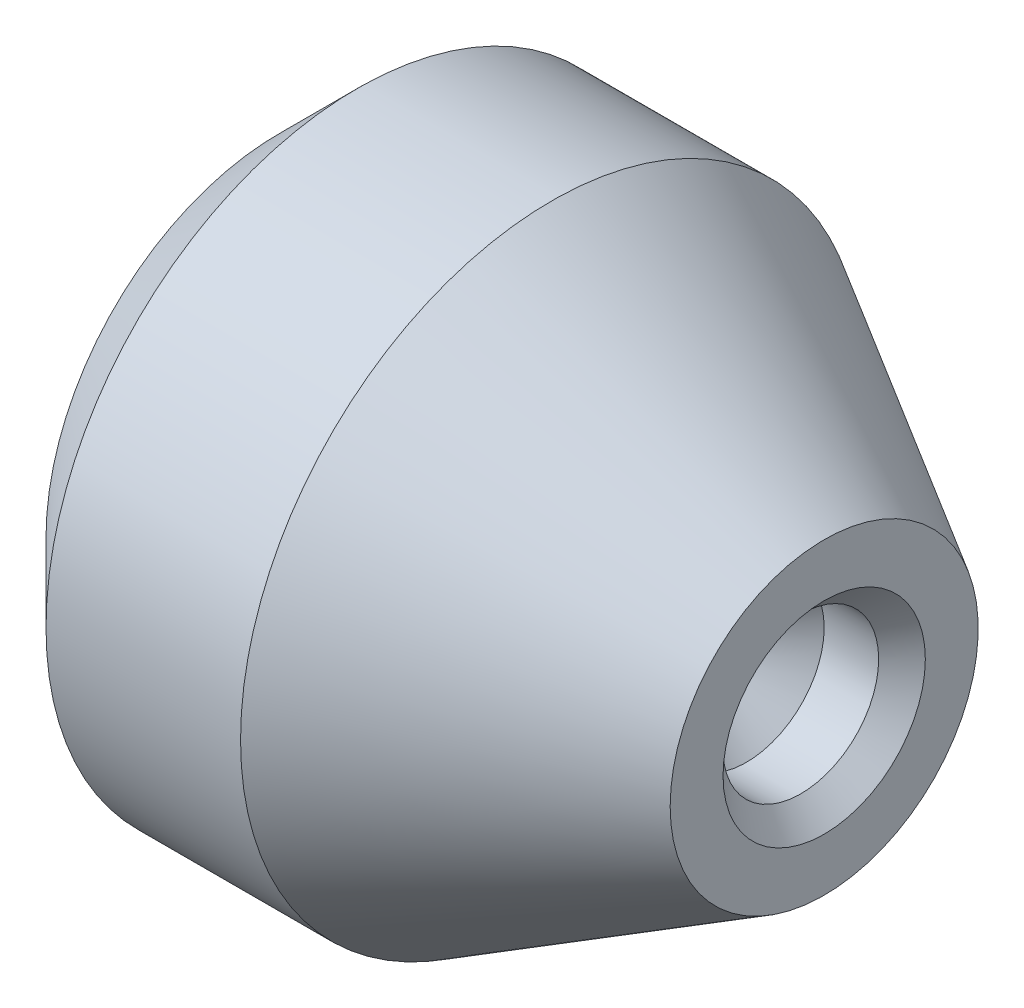
ISO-10303-21;
HEADER;
FILE_DESCRIPTION(('STEP AP214'),'2;1');
FILE_NAME('part.step','',(''),(''),'','','');
FILE_SCHEMA(('AUTOMOTIVE_DESIGN { 1 0 10303 214 1 1 1 1 }'));
ENDSEC;
DATA;
#1=APPLICATION_CONTEXT('core data for automotive mechanical design processes');
#2=APPLICATION_PROTOCOL_DEFINITION('international standard','automotive_design',2000,#1);
#3=PRODUCT_CONTEXT('',#1,'mechanical');
#4=PRODUCT('Part','Part','',(#3));
#5=PRODUCT_RELATED_PRODUCT_CATEGORY('part','',(#4));
#6=PRODUCT_DEFINITION_FORMATION('','',#4);
#7=PRODUCT_DEFINITION_CONTEXT('part definition',#1,'design');
#8=PRODUCT_DEFINITION('design','',#6,#7);
#9=PRODUCT_DEFINITION_SHAPE('','',#8);
#10=(LENGTH_UNIT() NAMED_UNIT(*) SI_UNIT(.MILLI.,.METRE.));
#11=(NAMED_UNIT(*) PLANE_ANGLE_UNIT() SI_UNIT($,.RADIAN.));
#12=(NAMED_UNIT(*) SI_UNIT($,.STERADIAN.) SOLID_ANGLE_UNIT());
#13=UNCERTAINTY_MEASURE_WITH_UNIT(LENGTH_MEASURE(1.E-05),#10,'distance_accuracy_value','');
#14=(GEOMETRIC_REPRESENTATION_CONTEXT(3) GLOBAL_UNCERTAINTY_ASSIGNED_CONTEXT((#13)) GLOBAL_UNIT_ASSIGNED_CONTEXT((#10,
#11,#12)) REPRESENTATION_CONTEXT('',''));
#15=CARTESIAN_POINT('',(0.,0.,0.));
#16=DIRECTION('',(0.,0.,1.));
#17=DIRECTION('',(1.,0.,0.));
#18=AXIS2_PLACEMENT_3D('',#15,#16,#17);
#19=CARTESIAN_POINT('',(0.,0.,0.));
#20=DIRECTION('',(1.,0.,0.));
#21=DIRECTION('',(0.,0.,-1.));
#22=AXIS2_PLACEMENT_3D('',#19,#20,#21);
#23=PLANE('',#22);
#24=CARTESIAN_POINT('',(0.,0.,0.));
#25=DIRECTION('',(-1.,0.,0.));
#26=DIRECTION('',(0.,0.,1.));
#27=AXIS2_PLACEMENT_3D('',#24,#25,#26);
#28=CIRCLE('',#27,2.5);
#29=CARTESIAN_POINT('',(0.,0.,2.5));
#30=VERTEX_POINT('',#29);
#31=EDGE_CURVE('E43',#30,#30,#28,.T.);
#32=ORIENTED_EDGE('',*,*,#31,.T.);
#33=EDGE_LOOP('',(#32));
#34=FACE_BOUND('',#33,.T.);
#35=ADVANCED_FACE('F36',(#34),#23,.F.);
#36=CARTESIAN_POINT('',(-1.08510638297872,0.,0.));
#37=DIRECTION('',(-1.,0.,0.));
#38=DIRECTION('',(0.,0.,1.));
#39=AXIS2_PLACEMENT_3D('',#36,#37,#38);
#40=CYLINDRICAL_SURFACE('',#39,2.5);
#41=ORIENTED_EDGE('',*,*,#31,.F.);
#42=EDGE_LOOP('',(#41));
#43=FACE_BOUND('',#42,.T.);
#44=CARTESIAN_POINT('',(-3.,0.,0.));
#45=DIRECTION('',(-1.,0.,0.));
#46=DIRECTION('',(0.,0.,1.));
#47=AXIS2_PLACEMENT_3D('',#44,#45,#46);
#48=CIRCLE('',#47,2.5);
#49=CARTESIAN_POINT('',(-3.,0.,2.5));
#50=VERTEX_POINT('',#49);
#51=EDGE_CURVE('E72',#50,#50,#48,.T.);
#52=ORIENTED_EDGE('',*,*,#51,.T.);
#53=EDGE_LOOP('',(#52));
#54=FACE_BOUND('',#53,.T.);
#55=ADVANCED_FACE('F78',(#43,#54),#40,.F.);
#56=CARTESIAN_POINT('',(-3.,0.,-2.5));
#57=DIRECTION('',(1.,0.,0.));
#58=DIRECTION('',(0.,0.,-1.));
#59=AXIS2_PLACEMENT_3D('',#56,#57,#58);
#60=PLANE('',#59);
#61=ORIENTED_EDGE('',*,*,#51,.F.);
#62=EDGE_LOOP('',(#61));
#63=FACE_BOUND('',#62,.T.);
#64=CARTESIAN_POINT('',(-3.,0.,0.));
#65=DIRECTION('',(-1.,0.,0.));
#66=DIRECTION('',(0.,0.,1.));
#67=AXIS2_PLACEMENT_3D('',#64,#65,#66);
#68=CIRCLE('',#67,3.);
#69=CARTESIAN_POINT('',(-3.,0.,3.));
#70=VERTEX_POINT('',#69);
#71=EDGE_CURVE('E69',#70,#70,#68,.T.);
#72=ORIENTED_EDGE('',*,*,#71,.T.);
#73=EDGE_LOOP('',(#72));
#74=FACE_BOUND('',#73,.T.);
#75=ADVANCED_FACE('F81',(#63,#74),#60,.F.);
#76=CARTESIAN_POINT('',(-2.,0.,0.));
#77=DIRECTION('',(1.,0.,0.));
#78=DIRECTION('',(0.,0.,-1.));
#79=AXIS2_PLACEMENT_3D('',#76,#77,#78);
#80=CONICAL_SURFACE('',#79,4.,0.785398163397448);
#81=ORIENTED_EDGE('',*,*,#71,.F.);
#82=EDGE_LOOP('',(#81));
#83=FACE_BOUND('',#82,.T.);
#84=CARTESIAN_POINT('',(-2.,0.,0.));
#85=DIRECTION('',(-1.,0.,0.));
#86=DIRECTION('',(0.,0.,1.));
#87=AXIS2_PLACEMENT_3D('',#84,#85,#86);
#88=CIRCLE('',#87,4.);
#89=CARTESIAN_POINT('',(-2.,0.,4.));
#90=VERTEX_POINT('',#89);
#91=EDGE_CURVE('E66',#90,#90,#88,.T.);
#92=ORIENTED_EDGE('',*,*,#91,.T.);
#93=EDGE_LOOP('',(#92));
#94=FACE_BOUND('',#93,.T.);
#95=ADVANCED_FACE('F87',(#83,#94),#80,.T.);
#96=CARTESIAN_POINT('',(-1.08510638297872,0.,0.));
#97=DIRECTION('',(-1.,0.,0.));
#98=DIRECTION('',(0.,0.,1.));
#99=AXIS2_PLACEMENT_3D('',#96,#97,#98);
#100=CYLINDRICAL_SURFACE('',#99,4.);
#101=ORIENTED_EDGE('',*,*,#91,.F.);
#102=EDGE_LOOP('',(#101));
#103=FACE_BOUND('',#102,.T.);
#104=CARTESIAN_POINT('',(0.5,0.,0.));
#105=DIRECTION('',(-1.,0.,0.));
#106=DIRECTION('',(0.,0.,1.));
#107=AXIS2_PLACEMENT_3D('',#104,#105,#106);
#108=CIRCLE('',#107,4.);
#109=CARTESIAN_POINT('',(0.5,0.,4.));
#110=VERTEX_POINT('',#109);
#111=EDGE_CURVE('E63',#110,#110,#108,.T.);
#112=ORIENTED_EDGE('',*,*,#111,.T.);
#113=EDGE_LOOP('',(#112));
#114=FACE_BOUND('',#113,.T.);
#115=ADVANCED_FACE('F93',(#103,#114),#100,.T.);
#116=CARTESIAN_POINT('',(4.,0.,0.));
#117=DIRECTION('',(-1.,0.,0.));
#118=DIRECTION('',(0.,0.,1.));
#119=AXIS2_PLACEMENT_3D('',#116,#117,#118);
#120=CONICAL_SURFACE('',#119,1.9792740578363,0.5235987755983);
#121=ORIENTED_EDGE('',*,*,#111,.F.);
#122=EDGE_LOOP('',(#121));
#123=FACE_BOUND('',#122,.T.);
#124=CARTESIAN_POINT('',(4.,0.,0.));
#125=DIRECTION('',(-1.,0.,0.));
#126=DIRECTION('',(0.,0.,1.));
#127=AXIS2_PLACEMENT_3D('',#124,#125,#126);
#128=CIRCLE('',#127,1.9792740578363);
#129=CARTESIAN_POINT('',(4.,0.,1.9792740578363));
#130=VERTEX_POINT('',#129);
#131=EDGE_CURVE('E58',#130,#130,#128,.T.);
#132=ORIENTED_EDGE('',*,*,#131,.T.);
#133=EDGE_LOOP('',(#132));
#134=FACE_BOUND('',#133,.T.);
#135=ADVANCED_FACE('F99',(#123,#134),#120,.T.);
#136=CARTESIAN_POINT('',(4.,0.,-1.9792740578363));
#137=DIRECTION('',(-1.,0.,0.));
#138=DIRECTION('',(0.,0.,1.));
#139=AXIS2_PLACEMENT_3D('',#136,#137,#138);
#140=PLANE('',#139);
#141=CARTESIAN_POINT('',(4.,0.,0.));
#142=DIRECTION('',(-1.,0.,0.));
#143=DIRECTION('',(0.,0.,1.));
#144=AXIS2_PLACEMENT_3D('',#141,#142,#143);
#145=CIRCLE('',#144,1.3);
#146=CARTESIAN_POINT('',(4.,0.,1.3));
#147=VERTEX_POINT('',#146);
#148=EDGE_CURVE('E11',#147,#147,#145,.T.);
#149=ORIENTED_EDGE('',*,*,#148,.T.);
#150=EDGE_LOOP('',(#149));
#151=FACE_BOUND('',#150,.T.);
#152=ORIENTED_EDGE('',*,*,#131,.F.);
#153=EDGE_LOOP('',(#152));
#154=FACE_BOUND('',#153,.T.);
#155=ADVANCED_FACE('F105',(#151,#154),#140,.F.);
#156=CARTESIAN_POINT('',(3.7,0.,0.));
#157=DIRECTION('',(1.,0.,0.));
#158=DIRECTION('',(0.,0.,-1.));
#159=AXIS2_PLACEMENT_3D('',#156,#157,#158);
#160=CONICAL_SURFACE('',#159,1.,0.78539816339745);
#161=ORIENTED_EDGE('',*,*,#148,.F.);
#162=EDGE_LOOP('',(#161));
#163=FACE_BOUND('',#162,.T.);
#164=CARTESIAN_POINT('',(3.7,0.,0.));
#165=DIRECTION('',(1.,0.,0.));
#166=DIRECTION('',(0.,0.,-1.));
#167=AXIS2_PLACEMENT_3D('',#164,#165,#166);
#168=CIRCLE('',#167,1.);
#169=CARTESIAN_POINT('',(3.7,0.,-1.));
#170=VERTEX_POINT('',#169);
#171=EDGE_CURVE('E55',#170,#170,#168,.T.);
#172=ORIENTED_EDGE('',*,*,#171,.F.);
#173=EDGE_LOOP('',(#172));
#174=FACE_BOUND('',#173,.T.);
#175=ADVANCED_FACE('F38',(#163,#174),#160,.F.);
#176=CARTESIAN_POINT('',(3.,0.,0.));
#177=DIRECTION('',(1.,0.,0.));
#178=DIRECTION('',(0.,0.,-1.));
#179=AXIS2_PLACEMENT_3D('',#176,#177,#178);
#180=CYLINDRICAL_SURFACE('',#179,1.);
#181=CARTESIAN_POINT('',(3.,0.,0.));
#182=DIRECTION('',(1.,0.,0.));
#183=DIRECTION('',(0.,0.,-1.));
#184=AXIS2_PLACEMENT_3D('',#181,#182,#183);
#185=CIRCLE('',#184,1.);
#186=CARTESIAN_POINT('',(3.,0.,-1.));
#187=VERTEX_POINT('',#186);
#188=EDGE_CURVE('E53',#187,#187,#185,.T.);
#189=ORIENTED_EDGE('',*,*,#188,.F.);
#190=EDGE_LOOP('',(#189));
#191=FACE_BOUND('',#190,.T.);
#192=ORIENTED_EDGE('',*,*,#171,.T.);
#193=EDGE_LOOP('',(#192));
#194=FACE_BOUND('',#193,.T.);
#195=ADVANCED_FACE('F49',(#191,#194),#180,.F.);
#196=CARTESIAN_POINT('',(3.,0.,0.));
#197=DIRECTION('',(1.,0.,0.));
#198=DIRECTION('',(0.,0.,-1.));
#199=AXIS2_PLACEMENT_3D('',#196,#197,#198);
#200=CONICAL_SURFACE('',#199,1.,0.78539816339745);
#201=CARTESIAN_POINT('',(2.,0.,0.));
#202=VERTEX_POINT('',#201);
#203=VERTEX_LOOP('',#202);
#204=FACE_BOUND('',#203,.T.);
#205=ORIENTED_EDGE('',*,*,#188,.T.);
#206=EDGE_LOOP('',(#205));
#207=FACE_BOUND('',#206,.T.);
#208=ADVANCED_FACE('F46',(#204,#207),#200,.F.);
#209=CLOSED_SHELL('',(#35,#55,#75,#95,#115,#135,#155,#175,#195,#208));
#210=MANIFOLD_SOLID_BREP('B2',#209);
#211=ADVANCED_BREP_SHAPE_REPRESENTATION('',(#18,#210),#14);
#212=SHAPE_DEFINITION_REPRESENTATION(#9,#211);
ENDSEC;
END-ISO-10303-21;
